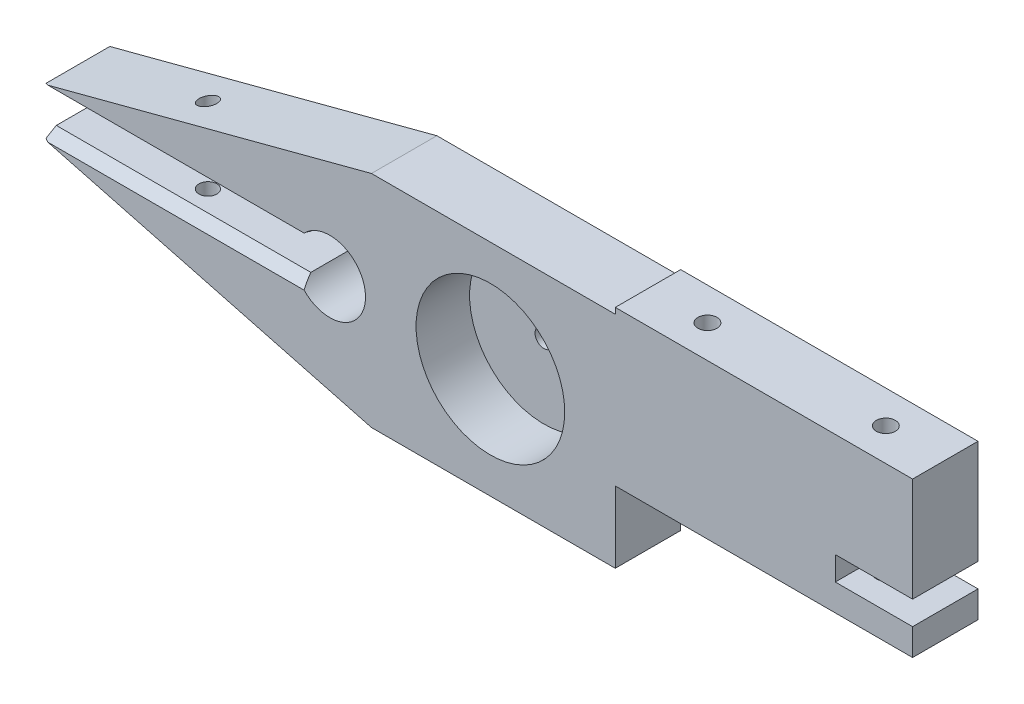
ISO-10303-21;
HEADER;
FILE_DESCRIPTION(('STEP AP214'),'2;1');
FILE_NAME('part.step','',(''),(''),'','','');
FILE_SCHEMA(('AUTOMOTIVE_DESIGN { 1 0 10303 214 1 1 1 1 }'));
ENDSEC;
DATA;
#1=APPLICATION_CONTEXT('core data for automotive mechanical design processes');
#2=APPLICATION_PROTOCOL_DEFINITION('international standard','automotive_design',2000,#1);
#3=PRODUCT_CONTEXT('',#1,'mechanical');
#4=PRODUCT('Part','Part','',(#3));
#5=PRODUCT_RELATED_PRODUCT_CATEGORY('part','',(#4));
#6=PRODUCT_DEFINITION_FORMATION('','',#4);
#7=PRODUCT_DEFINITION_CONTEXT('part definition',#1,'design');
#8=PRODUCT_DEFINITION('design','',#6,#7);
#9=PRODUCT_DEFINITION_SHAPE('','',#8);
#10=(LENGTH_UNIT() NAMED_UNIT(*) SI_UNIT(.MILLI.,.METRE.));
#11=(NAMED_UNIT(*) PLANE_ANGLE_UNIT() SI_UNIT($,.RADIAN.));
#12=(NAMED_UNIT(*) SI_UNIT($,.STERADIAN.) SOLID_ANGLE_UNIT());
#13=UNCERTAINTY_MEASURE_WITH_UNIT(LENGTH_MEASURE(1.E-05),#10,'distance_accuracy_value','');
#14=(GEOMETRIC_REPRESENTATION_CONTEXT(3) GLOBAL_UNCERTAINTY_ASSIGNED_CONTEXT((#13)) GLOBAL_UNIT_ASSIGNED_CONTEXT((#10,
#11,#12)) REPRESENTATION_CONTEXT('',''));
#15=CARTESIAN_POINT('',(0.,0.,0.));
#16=DIRECTION('',(0.,0.,1.));
#17=DIRECTION('',(1.,0.,0.));
#18=AXIS2_PLACEMENT_3D('',#15,#16,#17);
#19=CARTESIAN_POINT('',(61.,19.5,5.5));
#20=DIRECTION('',(-1.,0.,0.));
#21=DIRECTION('',(0.,0.,1.));
#22=AXIS2_PLACEMENT_3D('',#19,#20,#21);
#23=PLANE('',#22);
#24=DIRECTION('',(0.,1.,0.));
#25=VECTOR('',#24,1.);
#26=CARTESIAN_POINT('',(61.,19.5,-5.5));
#27=LINE('',#26,#25);
#28=CARTESIAN_POINT('',(61.,2.,-5.5));
#29=VERTEX_POINT('',#28);
#30=CARTESIAN_POINT('',(61.,19.5,-5.5));
#31=VERTEX_POINT('',#30);
#32=EDGE_CURVE('E170',#29,#31,#27,.T.);
#33=ORIENTED_EDGE('',*,*,#32,.T.);
#34=DIRECTION('',(0.,0.,-1.));
#35=VECTOR('',#34,1.);
#36=CARTESIAN_POINT('',(61.,19.5,5.5));
#37=LINE('',#36,#35);
#38=CARTESIAN_POINT('',(61.,19.5,5.5));
#39=VERTEX_POINT('',#38);
#40=EDGE_CURVE('E178',#39,#31,#37,.T.);
#41=ORIENTED_EDGE('',*,*,#40,.F.);
#42=DIRECTION('',(0.,1.,0.));
#43=VECTOR('',#42,1.);
#44=CARTESIAN_POINT('',(61.,19.5,5.5));
#45=LINE('',#44,#43);
#46=CARTESIAN_POINT('',(61.,2.,5.5));
#47=VERTEX_POINT('',#46);
#48=EDGE_CURVE('E235',#47,#39,#45,.T.);
#49=ORIENTED_EDGE('',*,*,#48,.F.);
#50=DIRECTION('',(0.,0.,-1.));
#51=VECTOR('',#50,1.);
#52=CARTESIAN_POINT('',(61.,2.,5.5));
#53=LINE('',#52,#51);
#54=EDGE_CURVE('E189',#47,#29,#53,.T.);
#55=ORIENTED_EDGE('',*,*,#54,.T.);
#56=EDGE_LOOP('',(#33,#41,#49,#55));
#57=FACE_BOUND('',#56,.T.);
#58=ADVANCED_FACE('F30',(#57),#23,.F.);
#59=CARTESIAN_POINT('',(61.,19.5,5.5));
#60=DIRECTION('',(0.,-1.,0.));
#61=DIRECTION('',(0.,0.,-1.));
#62=AXIS2_PLACEMENT_3D('',#59,#60,#61);
#63=PLANE('',#62);
#64=CARTESIAN_POINT('',(51.,19.5,0.));
#65=DIRECTION('',(0.,1.,0.));
#66=DIRECTION('',(0.,0.,1.));
#67=AXIS2_PLACEMENT_3D('',#64,#65,#66);
#68=CIRCLE('',#67,1.60000000000001);
#69=CARTESIAN_POINT('',(51.,19.5,1.60000000000001));
#70=VERTEX_POINT('',#69);
#71=EDGE_CURVE('E309',#70,#70,#68,.T.);
#72=ORIENTED_EDGE('',*,*,#71,.F.);
#73=EDGE_LOOP('',(#72));
#74=FACE_BOUND('',#73,.T.);
#75=CARTESIAN_POINT('',(21.,19.5,0.));
#76=DIRECTION('',(0.,1.,0.));
#77=DIRECTION('',(0.,0.,1.));
#78=AXIS2_PLACEMENT_3D('',#75,#76,#77);
#79=CIRCLE('',#78,1.60000000000001);
#80=CARTESIAN_POINT('',(21.,19.5,1.60000000000001));
#81=VERTEX_POINT('',#80);
#82=EDGE_CURVE('E193',#81,#81,#79,.T.);
#83=ORIENTED_EDGE('',*,*,#82,.F.);
#84=EDGE_LOOP('',(#83));
#85=FACE_BOUND('',#84,.T.);
#86=DIRECTION('',(-1.,0.,0.));
#87=VECTOR('',#86,1.);
#88=CARTESIAN_POINT('',(61.,19.5,-5.5));
#89=LINE('',#88,#87);
#90=CARTESIAN_POINT('',(11.,19.5,-5.5));
#91=VERTEX_POINT('',#90);
#92=EDGE_CURVE('E165',#31,#91,#89,.T.);
#93=ORIENTED_EDGE('',*,*,#92,.T.);
#94=DIRECTION('',(0.,0.,-1.));
#95=VECTOR('',#94,1.);
#96=CARTESIAN_POINT('',(11.,19.5,5.5));
#97=LINE('',#96,#95);
#98=CARTESIAN_POINT('',(11.,19.5,5.5));
#99=VERTEX_POINT('',#98);
#100=EDGE_CURVE('E185',#99,#91,#97,.T.);
#101=ORIENTED_EDGE('',*,*,#100,.F.);
#102=DIRECTION('',(-1.,0.,0.));
#103=VECTOR('',#102,1.);
#104=CARTESIAN_POINT('',(61.,19.5,5.5));
#105=LINE('',#104,#103);
#106=EDGE_CURVE('E180',#39,#99,#105,.T.);
#107=ORIENTED_EDGE('',*,*,#106,.F.);
#108=ORIENTED_EDGE('',*,*,#40,.T.);
#109=EDGE_LOOP('',(#93,#101,#107,#108));
#110=FACE_BOUND('',#109,.T.);
#111=ADVANCED_FACE('F179',(#74,#85,#110),#63,.F.);
#112=CARTESIAN_POINT('',(11.,19.5,5.5));
#113=DIRECTION('',(1.,0.,0.));
#114=DIRECTION('',(0.,1.,0.));
#115=AXIS2_PLACEMENT_3D('',#112,#113,#114);
#116=PLANE('',#115);
#117=DIRECTION('',(0.,-1.,0.));
#118=VECTOR('',#117,1.);
#119=CARTESIAN_POINT('',(11.,19.5,-5.5));
#120=LINE('',#119,#118);
#121=CARTESIAN_POINT('',(11.,18.5,-5.5));
#122=VERTEX_POINT('',#121);
#123=EDGE_CURVE('E172',#91,#122,#120,.T.);
#124=ORIENTED_EDGE('',*,*,#123,.T.);
#125=DIRECTION('',(0.,0.,-1.));
#126=VECTOR('',#125,1.);
#127=CARTESIAN_POINT('',(11.,18.5,5.5));
#128=LINE('',#127,#126);
#129=CARTESIAN_POINT('',(11.,18.5,5.5));
#130=VERTEX_POINT('',#129);
#131=EDGE_CURVE('E301',#130,#122,#128,.T.);
#132=ORIENTED_EDGE('',*,*,#131,.F.);
#133=DIRECTION('',(0.,-1.,0.));
#134=VECTOR('',#133,1.);
#135=CARTESIAN_POINT('',(11.,19.5,5.5));
#136=LINE('',#135,#134);
#137=EDGE_CURVE('E238',#99,#130,#136,.T.);
#138=ORIENTED_EDGE('',*,*,#137,.F.);
#139=ORIENTED_EDGE('',*,*,#100,.T.);
#140=EDGE_LOOP('',(#124,#132,#138,#139));
#141=FACE_BOUND('',#140,.T.);
#142=ADVANCED_FACE('F390',(#141),#116,.F.);
#143=CARTESIAN_POINT('',(-30.,18.5,5.5));
#144=DIRECTION('',(0.,-1.,0.));
#145=DIRECTION('',(1.,0.,0.));
#146=AXIS2_PLACEMENT_3D('',#143,#144,#145);
#147=PLANE('',#146);
#148=DIRECTION('',(-1.,0.,0.));
#149=VECTOR('',#148,1.);
#150=CARTESIAN_POINT('',(-30.,18.5,-5.5));
#151=LINE('',#150,#149);
#152=CARTESIAN_POINT('',(-30.,18.5,-5.5));
#153=VERTEX_POINT('',#152);
#154=EDGE_CURVE('E199',#122,#153,#151,.T.);
#155=ORIENTED_EDGE('',*,*,#154,.T.);
#156=DIRECTION('',(0.,0.,-1.));
#157=VECTOR('',#156,1.);
#158=CARTESIAN_POINT('',(-30.,18.5,5.5));
#159=LINE('',#158,#157);
#160=CARTESIAN_POINT('',(-30.,18.5,5.5));
#161=VERTEX_POINT('',#160);
#162=EDGE_CURVE('E298',#161,#153,#159,.T.);
#163=ORIENTED_EDGE('',*,*,#162,.F.);
#164=DIRECTION('',(-1.,0.,0.));
#165=VECTOR('',#164,1.);
#166=CARTESIAN_POINT('',(-30.,18.5,5.5));
#167=LINE('',#166,#165);
#168=EDGE_CURVE('E240',#130,#161,#167,.T.);
#169=ORIENTED_EDGE('',*,*,#168,.F.);
#170=ORIENTED_EDGE('',*,*,#131,.T.);
#171=EDGE_LOOP('',(#155,#163,#169,#170));
#172=FACE_BOUND('',#171,.T.);
#173=ADVANCED_FACE('F394',(#172),#147,.F.);
#174=CARTESIAN_POINT('',(-30.,18.5,5.5));
#175=DIRECTION('',(0.254925969305079,-0.966960573226161,0.));
#176=DIRECTION('',(0.966960573226161,0.254925969305079,0.));
#177=AXIS2_PLACEMENT_3D('',#174,#175,#176);
#178=PLANE('',#177);
#179=CARTESIAN_POINT('',(-63.,9.79999999999999,0.));
#180=DIRECTION('',(0.254925969305079,-0.966960573226161,0.));
#181=DIRECTION('',(0.966960573226161,0.254925969305079,0.));
#182=AXIS2_PLACEMENT_3D('',#179,#180,#181);
#183=ELLIPSE('',#182,1.55125249315534,1.5);
#184=CARTESIAN_POINT('',(-61.5,10.1954545454545,0.));
#185=VERTEX_POINT('',#184);
#186=EDGE_CURVE('E445',#185,#185,#183,.T.);
#187=ORIENTED_EDGE('',*,*,#186,.T.);
#188=EDGE_LOOP('',(#187));
#189=FACE_BOUND('',#188,.T.);
#190=DIRECTION('',(0.,0.,-1.));
#191=VECTOR('',#190,1.);
#192=CARTESIAN_POINT('',(-85.,3.99999999999999,5.5));
#193=LINE('',#192,#191);
#194=CARTESIAN_POINT('',(-85.,3.99999999999999,5.23205080756888));
#195=VERTEX_POINT('',#194);
#196=CARTESIAN_POINT('',(-85.,3.99999999999999,-5.5));
#197=VERTEX_POINT('',#196);
#198=EDGE_CURVE('E296',#195,#197,#193,.T.);
#199=ORIENTED_EDGE('',*,*,#198,.F.);
#200=DIRECTION('',(0.884569100485295,0.233204581037032,0.403922182913959));
#201=VECTOR('',#200,1.);
#202=CARTESIAN_POINT('',(-47.3141503576231,13.935360360263,22.4405997430505));
#203=LINE('',#202,#201);
#204=CARTESIAN_POINT('',(-84.4132048544235,4.15470053837924,5.5));
#205=VERTEX_POINT('',#204);
#206=EDGE_CURVE('E11',#195,#205,#203,.T.);
#207=ORIENTED_EDGE('',*,*,#206,.T.);
#208=DIRECTION('',(-0.966960573226161,-0.254925969305079,0.));
#209=VECTOR('',#208,1.);
#210=CARTESIAN_POINT('',(-30.,18.5,5.5));
#211=LINE('',#210,#209);
#212=EDGE_CURVE('E242',#161,#205,#211,.T.);
#213=ORIENTED_EDGE('',*,*,#212,.F.);
#214=ORIENTED_EDGE('',*,*,#162,.T.);
#215=DIRECTION('',(-0.966960573226161,-0.254925969305079,0.));
#216=VECTOR('',#215,1.);
#217=CARTESIAN_POINT('',(-30.,18.5,-5.5));
#218=LINE('',#217,#216);
#219=EDGE_CURVE('E201',#153,#197,#218,.T.);
#220=ORIENTED_EDGE('',*,*,#219,.T.);
#221=EDGE_LOOP('',(#199,#207,#213,#214,#220));
#222=FACE_BOUND('',#221,.T.);
#223=ADVANCED_FACE('F430',(#189,#222),#178,.F.);
#224=CARTESIAN_POINT('',(-85.,3.99999999999999,5.5));
#225=DIRECTION('',(1.,0.,0.));
#226=DIRECTION('',(0.,0.,-1.));
#227=AXIS2_PLACEMENT_3D('',#224,#225,#226);
#228=PLANE('',#227);
#229=DIRECTION('',(0.,0.,-1.));
#230=VECTOR('',#229,1.);
#231=CARTESIAN_POINT('',(-85.,2.99999999999999,5.5));
#232=LINE('',#231,#230);
#233=CARTESIAN_POINT('',(-85.,2.99999999999999,3.49999999999997));
#234=VERTEX_POINT('',#233);
#235=CARTESIAN_POINT('',(-85.,2.99999999999999,-5.5));
#236=VERTEX_POINT('',#235);
#237=EDGE_CURVE('E294',#234,#236,#232,.T.);
#238=ORIENTED_EDGE('',*,*,#237,.F.);
#239=DIRECTION('',(0.,0.499999999999995,0.866025403784442));
#240=VECTOR('',#239,1.);
#241=CARTESIAN_POINT('',(-85.,4.15470053837924,5.5));
#242=LINE('',#241,#240);
#243=EDGE_CURVE('E37',#234,#195,#242,.T.);
#244=ORIENTED_EDGE('',*,*,#243,.T.);
#245=ORIENTED_EDGE('',*,*,#198,.T.);
#246=DIRECTION('',(0.,-1.,0.));
#247=VECTOR('',#246,1.);
#248=CARTESIAN_POINT('',(-85.,3.99999999999999,-5.5));
#249=LINE('',#248,#247);
#250=EDGE_CURVE('E204',#197,#236,#249,.T.);
#251=ORIENTED_EDGE('',*,*,#250,.T.);
#252=EDGE_LOOP('',(#238,#244,#245,#251));
#253=FACE_BOUND('',#252,.T.);
#254=ADVANCED_FACE('F433',(#253),#228,.F.);
#255=CARTESIAN_POINT('',(-85.,2.99999999999999,5.5));
#256=DIRECTION('',(0.,1.,0.));
#257=DIRECTION('',(-1.,0.,0.));
#258=AXIS2_PLACEMENT_3D('',#255,#256,#257);
#259=PLANE('',#258);
#260=CARTESIAN_POINT('',(-63.,2.99999999999999,0.));
#261=DIRECTION('',(0.,1.,0.));
#262=DIRECTION('',(-1.,0.,0.));
#263=AXIS2_PLACEMENT_3D('',#260,#261,#262);
#264=CIRCLE('',#263,1.5);
#265=CARTESIAN_POINT('',(-64.5,2.99999999999999,0.));
#266=VERTEX_POINT('',#265);
#267=EDGE_CURVE('E443',#266,#266,#264,.T.);
#268=ORIENTED_EDGE('',*,*,#267,.T.);
#269=EDGE_LOOP('',(#268));
#270=FACE_BOUND('',#269,.T.);
#271=DIRECTION('',(0.,0.,-1.));
#272=VECTOR('',#271,1.);
#273=CARTESIAN_POINT('',(-42.1961524227066,2.99999999999999,5.5));
#274=LINE('',#273,#272);
#275=CARTESIAN_POINT('',(-42.1961524227066,2.99999999999999,3.49999999999997));
#276=VERTEX_POINT('',#275);
#277=CARTESIAN_POINT('',(-42.1961524227066,2.99999999999999,-5.5));
#278=VERTEX_POINT('',#277);
#279=EDGE_CURVE('E292',#276,#278,#274,.T.);
#280=ORIENTED_EDGE('',*,*,#279,.F.);
#281=DIRECTION('',(-1.,0.,0.));
#282=VECTOR('',#281,1.);
#283=CARTESIAN_POINT('',(-85.,2.99999999999999,3.49999999999997));
#284=LINE('',#283,#282);
#285=EDGE_CURVE('E51',#276,#234,#284,.T.);
#286=ORIENTED_EDGE('',*,*,#285,.T.);
#287=ORIENTED_EDGE('',*,*,#237,.T.);
#288=DIRECTION('',(1.,0.,0.));
#289=VECTOR('',#288,1.);
#290=CARTESIAN_POINT('',(-85.,2.99999999999999,-5.5));
#291=LINE('',#290,#289);
#292=EDGE_CURVE('E207',#236,#278,#291,.T.);
#293=ORIENTED_EDGE('',*,*,#292,.T.);
#294=EDGE_LOOP('',(#280,#286,#287,#293));
#295=FACE_BOUND('',#294,.T.);
#296=ADVANCED_FACE('F400',(#270,#295),#259,.F.);
#297=CARTESIAN_POINT('',(-37.,0.,5.5));
#298=DIRECTION('',(0.,0.,-1.));
#299=DIRECTION('',(-1.,0.,0.));
#300=AXIS2_PLACEMENT_3D('',#297,#298,#299);
#301=CYLINDRICAL_SURFACE('',#300,6.);
#302=DIRECTION('',(0.,0.,-1.));
#303=VECTOR('',#302,1.);
#304=CARTESIAN_POINT('',(-42.1961524227066,-3.00000000000001,5.5));
#305=LINE('',#304,#303);
#306=CARTESIAN_POINT('',(-42.1961524227066,-3.00000000000001,3.5));
#307=VERTEX_POINT('',#306);
#308=CARTESIAN_POINT('',(-42.1961524227066,-3.00000000000001,-5.5));
#309=VERTEX_POINT('',#308);
#310=EDGE_CURVE('E290',#307,#309,#305,.T.);
#311=ORIENTED_EDGE('',*,*,#310,.F.);
#312=CARTESIAN_POINT('',(-37.,0.,-1.6961524227067));
#313=DIRECTION('',(0.,0.866025403784441,0.499999999999995));
#314=DIRECTION('',(0.,0.499999999999995,-0.866025403784441));
#315=AXIS2_PLACEMENT_3D('',#312,#313,#314);
#316=ELLIPSE('',#315,12.0000000000001,6.);
#317=CARTESIAN_POINT('',(-41.3287946863291,-4.15470053837925,5.5));
#318=VERTEX_POINT('',#317);
#319=EDGE_CURVE('E328',#307,#318,#316,.T.);
#320=ORIENTED_EDGE('',*,*,#319,.T.);
#321=CARTESIAN_POINT('',(-37.,0.,5.5));
#322=DIRECTION('',(0.,0.,-1.));
#323=DIRECTION('',(1.,0.,0.));
#324=AXIS2_PLACEMENT_3D('',#321,#322,#323);
#325=CIRCLE('',#324,6.);
#326=CARTESIAN_POINT('',(-41.3287946863291,4.15470053837924,5.5));
#327=VERTEX_POINT('',#326);
#328=EDGE_CURVE('E245',#327,#318,#325,.T.);
#329=ORIENTED_EDGE('',*,*,#328,.F.);
#330=CARTESIAN_POINT('',(-37.,0.,-1.69615242270673));
#331=DIRECTION('',(0.,-0.866025403784442,0.499999999999995));
#332=DIRECTION('',(0.,-0.499999999999995,-0.866025403784442));
#333=AXIS2_PLACEMENT_3D('',#330,#331,#332);
#334=ELLIPSE('',#333,12.0000000000001,6.);
#335=EDGE_CURVE('E326',#327,#276,#334,.T.);
#336=ORIENTED_EDGE('',*,*,#335,.T.);
#337=ORIENTED_EDGE('',*,*,#279,.T.);
#338=CARTESIAN_POINT('',(-37.,0.,-5.5));
#339=DIRECTION('',(0.,0.,-1.));
#340=DIRECTION('',(1.,0.,0.));
#341=AXIS2_PLACEMENT_3D('',#338,#339,#340);
#342=CIRCLE('',#341,6.);
#343=EDGE_CURVE('E210',#278,#309,#342,.T.);
#344=ORIENTED_EDGE('',*,*,#343,.T.);
#345=EDGE_LOOP('',(#311,#320,#329,#336,#337,#344));
#346=FACE_BOUND('',#345,.T.);
#347=ADVANCED_FACE('F334',(#346),#301,.F.);
#348=CARTESIAN_POINT('',(-85.,-3.00000000000001,5.5));
#349=DIRECTION('',(0.,-1.,0.));
#350=DIRECTION('',(1.,0.,0.));
#351=AXIS2_PLACEMENT_3D('',#348,#349,#350);
#352=PLANE('',#351);
#353=CARTESIAN_POINT('',(-63.,-3.00000000000001,0.));
#354=DIRECTION('',(0.,-1.,0.));
#355=DIRECTION('',(1.,0.,0.));
#356=AXIS2_PLACEMENT_3D('',#353,#354,#355);
#357=CIRCLE('',#356,1.5);
#358=CARTESIAN_POINT('',(-61.5,-3.00000000000001,0.));
#359=VERTEX_POINT('',#358);
#360=EDGE_CURVE('E313',#359,#359,#357,.T.);
#361=ORIENTED_EDGE('',*,*,#360,.T.);
#362=EDGE_LOOP('',(#361));
#363=FACE_BOUND('',#362,.T.);
#364=DIRECTION('',(0.,0.,-1.));
#365=VECTOR('',#364,1.);
#366=CARTESIAN_POINT('',(-85.,-3.00000000000001,5.5));
#367=LINE('',#366,#365);
#368=CARTESIAN_POINT('',(-85.,-3.00000000000001,3.5));
#369=VERTEX_POINT('',#368);
#370=CARTESIAN_POINT('',(-85.,-3.00000000000001,-5.5));
#371=VERTEX_POINT('',#370);
#372=EDGE_CURVE('E288',#369,#371,#367,.T.);
#373=ORIENTED_EDGE('',*,*,#372,.F.);
#374=DIRECTION('',(1.,0.,0.));
#375=VECTOR('',#374,1.);
#376=CARTESIAN_POINT('',(-42.1961524227066,-3.00000000000001,3.5));
#377=LINE('',#376,#375);
#378=EDGE_CURVE('E324',#369,#307,#377,.T.);
#379=ORIENTED_EDGE('',*,*,#378,.T.);
#380=ORIENTED_EDGE('',*,*,#310,.T.);
#381=DIRECTION('',(-1.,0.,0.));
#382=VECTOR('',#381,1.);
#383=CARTESIAN_POINT('',(-85.,-3.00000000000001,-5.5));
#384=LINE('',#383,#382);
#385=EDGE_CURVE('E213',#309,#371,#384,.T.);
#386=ORIENTED_EDGE('',*,*,#385,.T.);
#387=EDGE_LOOP('',(#373,#379,#380,#386));
#388=FACE_BOUND('',#387,.T.);
#389=ADVANCED_FACE('F405',(#363,#388),#352,.F.);
#390=CARTESIAN_POINT('',(-85.,-4.00000000000001,5.5));
#391=DIRECTION('',(1.,0.,0.));
#392=DIRECTION('',(0.,0.,-1.));
#393=AXIS2_PLACEMENT_3D('',#390,#391,#392);
#394=PLANE('',#393);
#395=DIRECTION('',(0.,0.,-1.));
#396=VECTOR('',#395,1.);
#397=CARTESIAN_POINT('',(-85.,-4.00000000000001,5.5));
#398=LINE('',#397,#396);
#399=CARTESIAN_POINT('',(-85.,-4.00000000000001,5.2320508075689));
#400=VERTEX_POINT('',#399);
#401=CARTESIAN_POINT('',(-85.,-4.00000000000001,-5.5));
#402=VERTEX_POINT('',#401);
#403=EDGE_CURVE('E286',#400,#402,#398,.T.);
#404=ORIENTED_EDGE('',*,*,#403,.F.);
#405=DIRECTION('',(0.,0.499999999999995,-0.866025403784441));
#406=VECTOR('',#405,1.);
#407=CARTESIAN_POINT('',(-85.,-4.15470053837925,5.5));
#408=LINE('',#407,#406);
#409=EDGE_CURVE('E322',#400,#369,#408,.T.);
#410=ORIENTED_EDGE('',*,*,#409,.T.);
#411=ORIENTED_EDGE('',*,*,#372,.T.);
#412=DIRECTION('',(0.,-1.,0.));
#413=VECTOR('',#412,1.);
#414=CARTESIAN_POINT('',(-85.,-4.00000000000001,-5.5));
#415=LINE('',#414,#413);
#416=EDGE_CURVE('E216',#371,#402,#415,.T.);
#417=ORIENTED_EDGE('',*,*,#416,.T.);
#418=EDGE_LOOP('',(#404,#410,#411,#417));
#419=FACE_BOUND('',#418,.T.);
#420=ADVANCED_FACE('F349',(#419),#394,.F.);
#421=CARTESIAN_POINT('',(-85.,-4.00000000000001,5.5));
#422=DIRECTION('',(0.254925969305079,0.966960573226161,0.));
#423=DIRECTION('',(-0.966960573226161,0.254925969305079,0.));
#424=AXIS2_PLACEMENT_3D('',#421,#422,#423);
#425=PLANE('',#424);
#426=CARTESIAN_POINT('',(-63.,-9.8,0.));
#427=DIRECTION('',(0.254925969305079,0.966960573226161,0.));
#428=DIRECTION('',(-0.966960573226161,0.254925969305079,0.));
#429=AXIS2_PLACEMENT_3D('',#426,#427,#428);
#430=ELLIPSE('',#429,1.55125249315534,1.5);
#431=CARTESIAN_POINT('',(-64.5,-9.40454545454546,0.));
#432=VERTEX_POINT('',#431);
#433=EDGE_CURVE('E310',#432,#432,#430,.T.);
#434=ORIENTED_EDGE('',*,*,#433,.T.);
#435=EDGE_LOOP('',(#434));
#436=FACE_BOUND('',#435,.T.);
#437=DIRECTION('',(0.966960573226161,-0.254925969305078,0.));
#438=VECTOR('',#437,1.);
#439=CARTESIAN_POINT('',(-85.,-4.00000000000001,5.5));
#440=LINE('',#439,#438);
#441=CARTESIAN_POINT('',(-84.4132048544236,-4.15470053837924,5.5));
#442=VERTEX_POINT('',#441);
#443=CARTESIAN_POINT('',(-30.,-18.5,5.5));
#444=VERTEX_POINT('',#443);
#445=EDGE_CURVE('E248',#442,#444,#440,.T.);
#446=ORIENTED_EDGE('',*,*,#445,.F.);
#447=DIRECTION('',(-0.884569100485296,0.233204581037032,-0.403922182913958));
#448=VECTOR('',#447,1.);
#449=CARTESIAN_POINT('',(-47.3141503576231,-13.935360360263,22.4405997430504));
#450=LINE('',#449,#448);
#451=EDGE_CURVE('E320',#442,#400,#450,.T.);
#452=ORIENTED_EDGE('',*,*,#451,.T.);
#453=ORIENTED_EDGE('',*,*,#403,.T.);
#454=DIRECTION('',(0.966960573226161,-0.254925969305078,0.));
#455=VECTOR('',#454,1.);
#456=CARTESIAN_POINT('',(-85.,-4.00000000000001,-5.5));
#457=LINE('',#456,#455);
#458=CARTESIAN_POINT('',(-30.,-18.5,-5.5));
#459=VERTEX_POINT('',#458);
#460=EDGE_CURVE('E219',#402,#459,#457,.T.);
#461=ORIENTED_EDGE('',*,*,#460,.T.);
#462=DIRECTION('',(0.,0.,-1.));
#463=VECTOR('',#462,1.);
#464=CARTESIAN_POINT('',(-30.,-18.5,5.5));
#465=LINE('',#464,#463);
#466=EDGE_CURVE('E283',#444,#459,#465,.T.);
#467=ORIENTED_EDGE('',*,*,#466,.F.);
#468=EDGE_LOOP('',(#446,#452,#453,#461,#467));
#469=FACE_BOUND('',#468,.T.);
#470=ADVANCED_FACE('F346',(#436,#469),#425,.F.);
#471=CARTESIAN_POINT('',(11.,-18.5,5.5));
#472=DIRECTION('',(0.,1.,0.));
#473=DIRECTION('',(-1.,0.,0.));
#474=AXIS2_PLACEMENT_3D('',#471,#472,#473);
#475=PLANE('',#474);
#476=DIRECTION('',(1.,0.,0.));
#477=VECTOR('',#476,1.);
#478=CARTESIAN_POINT('',(11.,-18.5,-5.5));
#479=LINE('',#478,#477);
#480=CARTESIAN_POINT('',(11.,-18.5,-5.5));
#481=VERTEX_POINT('',#480);
#482=EDGE_CURVE('E221',#459,#481,#479,.T.);
#483=ORIENTED_EDGE('',*,*,#482,.T.);
#484=DIRECTION('',(0.,0.,-1.));
#485=VECTOR('',#484,1.);
#486=CARTESIAN_POINT('',(11.,-18.5,5.5));
#487=LINE('',#486,#485);
#488=CARTESIAN_POINT('',(11.,-18.5,5.5));
#489=VERTEX_POINT('',#488);
#490=EDGE_CURVE('E280',#489,#481,#487,.T.);
#491=ORIENTED_EDGE('',*,*,#490,.F.);
#492=DIRECTION('',(1.,0.,0.));
#493=VECTOR('',#492,1.);
#494=CARTESIAN_POINT('',(11.,-18.5,5.5));
#495=LINE('',#494,#493);
#496=EDGE_CURVE('E250',#444,#489,#495,.T.);
#497=ORIENTED_EDGE('',*,*,#496,.F.);
#498=ORIENTED_EDGE('',*,*,#466,.T.);
#499=EDGE_LOOP('',(#483,#491,#497,#498));
#500=FACE_BOUND('',#499,.T.);
#501=ADVANCED_FACE('F358',(#500),#475,.F.);
#502=CARTESIAN_POINT('',(11.,-6.5,5.5));
#503=DIRECTION('',(-1.,0.,0.));
#504=DIRECTION('',(0.,-1.,0.));
#505=AXIS2_PLACEMENT_3D('',#502,#503,#504);
#506=PLANE('',#505);
#507=DIRECTION('',(0.,1.,0.));
#508=VECTOR('',#507,1.);
#509=CARTESIAN_POINT('',(11.,-6.5,-5.5));
#510=LINE('',#509,#508);
#511=CARTESIAN_POINT('',(11.,-6.5,-5.5));
#512=VERTEX_POINT('',#511);
#513=EDGE_CURVE('E223',#481,#512,#510,.T.);
#514=ORIENTED_EDGE('',*,*,#513,.T.);
#515=DIRECTION('',(0.,0.,-1.));
#516=VECTOR('',#515,1.);
#517=CARTESIAN_POINT('',(11.,-6.5,5.5));
#518=LINE('',#517,#516);
#519=CARTESIAN_POINT('',(11.,-6.5,5.5));
#520=VERTEX_POINT('',#519);
#521=EDGE_CURVE('E277',#520,#512,#518,.T.);
#522=ORIENTED_EDGE('',*,*,#521,.F.);
#523=DIRECTION('',(0.,1.,0.));
#524=VECTOR('',#523,1.);
#525=CARTESIAN_POINT('',(11.,-6.5,5.5));
#526=LINE('',#525,#524);
#527=EDGE_CURVE('E252',#489,#520,#526,.T.);
#528=ORIENTED_EDGE('',*,*,#527,.F.);
#529=ORIENTED_EDGE('',*,*,#490,.T.);
#530=EDGE_LOOP('',(#514,#522,#528,#529));
#531=FACE_BOUND('',#530,.T.);
#532=ADVANCED_FACE('F365',(#531),#506,.F.);
#533=CARTESIAN_POINT('',(61.,-6.5,5.5));
#534=DIRECTION('',(0.,1.,0.));
#535=DIRECTION('',(-1.,0.,0.));
#536=AXIS2_PLACEMENT_3D('',#533,#534,#535);
#537=PLANE('',#536);
#538=CARTESIAN_POINT('',(51.,-6.5,0.));
#539=DIRECTION('',(0.,1.,0.));
#540=DIRECTION('',(-1.,0.,0.));
#541=AXIS2_PLACEMENT_3D('',#538,#539,#540);
#542=CIRCLE('',#541,1.60000000000001);
#543=CARTESIAN_POINT('',(49.4,-6.5,0.));
#544=VERTEX_POINT('',#543);
#545=EDGE_CURVE('E455',#544,#544,#542,.T.);
#546=ORIENTED_EDGE('',*,*,#545,.T.);
#547=EDGE_LOOP('',(#546));
#548=FACE_BOUND('',#547,.T.);
#549=CARTESIAN_POINT('',(21.,-6.5,0.));
#550=DIRECTION('',(0.,1.,0.));
#551=DIRECTION('',(-1.,0.,0.));
#552=AXIS2_PLACEMENT_3D('',#549,#550,#551);
#553=CIRCLE('',#552,1.60000000000001);
#554=CARTESIAN_POINT('',(19.4,-6.5,0.));
#555=VERTEX_POINT('',#554);
#556=EDGE_CURVE('E190',#555,#555,#553,.T.);
#557=ORIENTED_EDGE('',*,*,#556,.T.);
#558=EDGE_LOOP('',(#557));
#559=FACE_BOUND('',#558,.T.);
#560=DIRECTION('',(1.,0.,0.));
#561=VECTOR('',#560,1.);
#562=CARTESIAN_POINT('',(61.,-6.5,-5.5));
#563=LINE('',#562,#561);
#564=CARTESIAN_POINT('',(61.,-6.5,-5.5));
#565=VERTEX_POINT('',#564);
#566=EDGE_CURVE('E225',#512,#565,#563,.T.);
#567=ORIENTED_EDGE('',*,*,#566,.T.);
#568=DIRECTION('',(0.,0.,-1.));
#569=VECTOR('',#568,1.);
#570=CARTESIAN_POINT('',(61.,-6.5,5.5));
#571=LINE('',#570,#569);
#572=CARTESIAN_POINT('',(61.,-6.5,5.5));
#573=VERTEX_POINT('',#572);
#574=EDGE_CURVE('E274',#573,#565,#571,.T.);
#575=ORIENTED_EDGE('',*,*,#574,.F.);
#576=DIRECTION('',(1.,0.,0.));
#577=VECTOR('',#576,1.);
#578=CARTESIAN_POINT('',(61.,-6.5,5.5));
#579=LINE('',#578,#577);
#580=EDGE_CURVE('E254',#520,#573,#579,.T.);
#581=ORIENTED_EDGE('',*,*,#580,.F.);
#582=ORIENTED_EDGE('',*,*,#521,.T.);
#583=EDGE_LOOP('',(#567,#575,#581,#582));
#584=FACE_BOUND('',#583,.T.);
#585=ADVANCED_FACE('F368',(#548,#559,#584),#537,.F.);
#586=CARTESIAN_POINT('',(61.,-2.,5.5));
#587=DIRECTION('',(-1.,0.,0.));
#588=DIRECTION('',(0.,-1.,0.));
#589=AXIS2_PLACEMENT_3D('',#586,#587,#588);
#590=PLANE('',#589);
#591=DIRECTION('',(0.,1.,0.));
#592=VECTOR('',#591,1.);
#593=CARTESIAN_POINT('',(61.,-2.,-5.5));
#594=LINE('',#593,#592);
#595=CARTESIAN_POINT('',(61.,-2.,-5.5));
#596=VERTEX_POINT('',#595);
#597=EDGE_CURVE('E227',#565,#596,#594,.T.);
#598=ORIENTED_EDGE('',*,*,#597,.T.);
#599=DIRECTION('',(0.,0.,-1.));
#600=VECTOR('',#599,1.);
#601=CARTESIAN_POINT('',(61.,-2.,5.5));
#602=LINE('',#601,#600);
#603=CARTESIAN_POINT('',(61.,-2.,5.5));
#604=VERTEX_POINT('',#603);
#605=EDGE_CURVE('E271',#604,#596,#602,.T.);
#606=ORIENTED_EDGE('',*,*,#605,.F.);
#607=DIRECTION('',(0.,1.,0.));
#608=VECTOR('',#607,1.);
#609=CARTESIAN_POINT('',(61.,-2.,5.5));
#610=LINE('',#609,#608);
#611=EDGE_CURVE('E256',#573,#604,#610,.T.);
#612=ORIENTED_EDGE('',*,*,#611,.F.);
#613=ORIENTED_EDGE('',*,*,#574,.T.);
#614=EDGE_LOOP('',(#598,#606,#612,#613));
#615=FACE_BOUND('',#614,.T.);
#616=ADVANCED_FACE('F373',(#615),#590,.F.);
#617=CARTESIAN_POINT('',(61.,-2.,5.5));
#618=DIRECTION('',(0.,-1.,0.));
#619=DIRECTION('',(1.,0.,0.));
#620=AXIS2_PLACEMENT_3D('',#617,#618,#619);
#621=PLANE('',#620);
#622=CARTESIAN_POINT('',(51.,-2.,0.));
#623=DIRECTION('',(0.,-1.,0.));
#624=DIRECTION('',(1.,0.,0.));
#625=AXIS2_PLACEMENT_3D('',#622,#623,#624);
#626=CIRCLE('',#625,1.60000000000001);
#627=CARTESIAN_POINT('',(52.6,-2.,0.));
#628=VERTEX_POINT('',#627);
#629=EDGE_CURVE('E308',#628,#628,#626,.T.);
#630=ORIENTED_EDGE('',*,*,#629,.T.);
#631=EDGE_LOOP('',(#630));
#632=FACE_BOUND('',#631,.T.);
#633=DIRECTION('',(-1.,0.,0.));
#634=VECTOR('',#633,1.);
#635=CARTESIAN_POINT('',(61.,-2.,-5.5));
#636=LINE('',#635,#634);
#637=CARTESIAN_POINT('',(48.,-2.,-5.5));
#638=VERTEX_POINT('',#637);
#639=EDGE_CURVE('E229',#596,#638,#636,.T.);
#640=ORIENTED_EDGE('',*,*,#639,.T.);
#641=DIRECTION('',(0.,0.,-1.));
#642=VECTOR('',#641,1.);
#643=CARTESIAN_POINT('',(48.,-2.,5.5));
#644=LINE('',#643,#642);
#645=CARTESIAN_POINT('',(48.,-2.,5.5));
#646=VERTEX_POINT('',#645);
#647=EDGE_CURVE('E268',#646,#638,#644,.T.);
#648=ORIENTED_EDGE('',*,*,#647,.F.);
#649=DIRECTION('',(-1.,0.,0.));
#650=VECTOR('',#649,1.);
#651=CARTESIAN_POINT('',(61.,-2.,5.5));
#652=LINE('',#651,#650);
#653=EDGE_CURVE('E258',#604,#646,#652,.T.);
#654=ORIENTED_EDGE('',*,*,#653,.F.);
#655=ORIENTED_EDGE('',*,*,#605,.T.);
#656=EDGE_LOOP('',(#640,#648,#654,#655));
#657=FACE_BOUND('',#656,.T.);
#658=ADVANCED_FACE('F379',(#632,#657),#621,.F.);
#659=CARTESIAN_POINT('',(48.,2.,5.5));
#660=DIRECTION('',(-1.,0.,0.));
#661=DIRECTION('',(0.,0.,1.));
#662=AXIS2_PLACEMENT_3D('',#659,#660,#661);
#663=PLANE('',#662);
#664=DIRECTION('',(0.,1.,0.));
#665=VECTOR('',#664,1.);
#666=CARTESIAN_POINT('',(48.,2.,-5.5));
#667=LINE('',#666,#665);
#668=CARTESIAN_POINT('',(48.,2.,-5.5));
#669=VERTEX_POINT('',#668);
#670=EDGE_CURVE('E231',#638,#669,#667,.T.);
#671=ORIENTED_EDGE('',*,*,#670,.T.);
#672=DIRECTION('',(0.,0.,-1.));
#673=VECTOR('',#672,1.);
#674=CARTESIAN_POINT('',(48.,2.,5.5));
#675=LINE('',#674,#673);
#676=CARTESIAN_POINT('',(48.,2.,5.5));
#677=VERTEX_POINT('',#676);
#678=EDGE_CURVE('E265',#677,#669,#675,.T.);
#679=ORIENTED_EDGE('',*,*,#678,.F.);
#680=DIRECTION('',(0.,1.,0.));
#681=VECTOR('',#680,1.);
#682=CARTESIAN_POINT('',(48.,2.,5.5));
#683=LINE('',#682,#681);
#684=EDGE_CURVE('E260',#646,#677,#683,.T.);
#685=ORIENTED_EDGE('',*,*,#684,.F.);
#686=ORIENTED_EDGE('',*,*,#647,.T.);
#687=EDGE_LOOP('',(#671,#679,#685,#686));
#688=FACE_BOUND('',#687,.T.);
#689=ADVANCED_FACE('F383',(#688),#663,.F.);
#690=CARTESIAN_POINT('',(61.,2.,5.5));
#691=DIRECTION('',(0.,1.,0.));
#692=DIRECTION('',(-1.,0.,0.));
#693=AXIS2_PLACEMENT_3D('',#690,#691,#692);
#694=PLANE('',#693);
#695=CARTESIAN_POINT('',(51.,2.,0.));
#696=DIRECTION('',(0.,1.,0.));
#697=DIRECTION('',(-1.,0.,0.));
#698=AXIS2_PLACEMENT_3D('',#695,#696,#697);
#699=CIRCLE('',#698,1.60000000000001);
#700=CARTESIAN_POINT('',(49.4,2.,0.));
#701=VERTEX_POINT('',#700);
#702=EDGE_CURVE('E305',#701,#701,#699,.T.);
#703=ORIENTED_EDGE('',*,*,#702,.T.);
#704=EDGE_LOOP('',(#703));
#705=FACE_BOUND('',#704,.T.);
#706=DIRECTION('',(1.,0.,0.));
#707=VECTOR('',#706,1.);
#708=CARTESIAN_POINT('',(61.,2.,-5.5));
#709=LINE('',#708,#707);
#710=EDGE_CURVE('E233',#669,#29,#709,.T.);
#711=ORIENTED_EDGE('',*,*,#710,.T.);
#712=ORIENTED_EDGE('',*,*,#54,.F.);
#713=DIRECTION('',(1.,0.,0.));
#714=VECTOR('',#713,1.);
#715=CARTESIAN_POINT('',(61.,2.,5.5));
#716=LINE('',#715,#714);
#717=EDGE_CURVE('E262',#677,#47,#716,.T.);
#718=ORIENTED_EDGE('',*,*,#717,.F.);
#719=ORIENTED_EDGE('',*,*,#678,.T.);
#720=EDGE_LOOP('',(#711,#712,#718,#719));
#721=FACE_BOUND('',#720,.T.);
#722=ADVANCED_FACE('F386',(#705,#721),#694,.F.);
#723=CARTESIAN_POINT('',(-37.,0.,5.5));
#724=DIRECTION('',(0.,0.,1.));
#725=DIRECTION('',(1.,0.,0.));
#726=AXIS2_PLACEMENT_3D('',#723,#724,#725);
#727=PLANE('',#726);
#728=CARTESIAN_POINT('',(-10.,0.,5.5));
#729=DIRECTION('',(0.,0.,1.));
#730=DIRECTION('',(1.,0.,0.));
#731=AXIS2_PLACEMENT_3D('',#728,#729,#730);
#732=CIRCLE('',#731,12.5);
#733=CARTESIAN_POINT('',(2.5,0.,5.5));
#734=VERTEX_POINT('',#733);
#735=EDGE_CURVE('E653',#734,#734,#732,.T.);
#736=ORIENTED_EDGE('',*,*,#735,.F.);
#737=EDGE_LOOP('',(#736));
#738=FACE_BOUND('',#737,.T.);
#739=ORIENTED_EDGE('',*,*,#328,.T.);
#740=DIRECTION('',(-1.,0.,0.));
#741=VECTOR('',#740,1.);
#742=CARTESIAN_POINT('',(-85.,-4.15470053837925,5.5));
#743=LINE('',#742,#741);
#744=EDGE_CURVE('E317',#318,#442,#743,.T.);
#745=ORIENTED_EDGE('',*,*,#744,.T.);
#746=ORIENTED_EDGE('',*,*,#445,.T.);
#747=ORIENTED_EDGE('',*,*,#496,.T.);
#748=ORIENTED_EDGE('',*,*,#527,.T.);
#749=ORIENTED_EDGE('',*,*,#580,.T.);
#750=ORIENTED_EDGE('',*,*,#611,.T.);
#751=ORIENTED_EDGE('',*,*,#653,.T.);
#752=ORIENTED_EDGE('',*,*,#684,.T.);
#753=ORIENTED_EDGE('',*,*,#717,.T.);
#754=ORIENTED_EDGE('',*,*,#48,.T.);
#755=ORIENTED_EDGE('',*,*,#106,.T.);
#756=ORIENTED_EDGE('',*,*,#137,.T.);
#757=ORIENTED_EDGE('',*,*,#168,.T.);
#758=ORIENTED_EDGE('',*,*,#212,.T.);
#759=DIRECTION('',(1.,0.,0.));
#760=VECTOR('',#759,1.);
#761=CARTESIAN_POINT('',(-42.1961524227066,4.15470053837924,5.5));
#762=LINE('',#761,#760);
#763=EDGE_CURVE('E184',#205,#327,#762,.T.);
#764=ORIENTED_EDGE('',*,*,#763,.T.);
#765=EDGE_LOOP('',(#739,#745,#746,#747,#748,#749,#750,#751,#752,#753,#754,#755,#756,#757,#758,#764));
#766=FACE_BOUND('',#765,.T.);
#767=ADVANCED_FACE('F339',(#738,#766),#727,.T.);
#768=CARTESIAN_POINT('',(-37.,0.,-5.5));
#769=DIRECTION('',(0.,0.,1.));
#770=DIRECTION('',(1.,0.,0.));
#771=AXIS2_PLACEMENT_3D('',#768,#769,#770);
#772=PLANE('',#771);
#773=CARTESIAN_POINT('',(-10.,0.,-5.5));
#774=DIRECTION('',(0.,0.,1.));
#775=DIRECTION('',(1.,0.,0.));
#776=AXIS2_PLACEMENT_3D('',#773,#774,#775);
#777=CIRCLE('',#776,1.5);
#778=CARTESIAN_POINT('',(-8.5,0.,-5.5));
#779=VERTEX_POINT('',#778);
#780=EDGE_CURVE('E314',#779,#779,#777,.T.);
#781=ORIENTED_EDGE('',*,*,#780,.T.);
#782=EDGE_LOOP('',(#781));
#783=FACE_BOUND('',#782,.T.);
#784=ORIENTED_EDGE('',*,*,#32,.F.);
#785=ORIENTED_EDGE('',*,*,#710,.F.);
#786=ORIENTED_EDGE('',*,*,#670,.F.);
#787=ORIENTED_EDGE('',*,*,#639,.F.);
#788=ORIENTED_EDGE('',*,*,#597,.F.);
#789=ORIENTED_EDGE('',*,*,#566,.F.);
#790=ORIENTED_EDGE('',*,*,#513,.F.);
#791=ORIENTED_EDGE('',*,*,#482,.F.);
#792=ORIENTED_EDGE('',*,*,#460,.F.);
#793=ORIENTED_EDGE('',*,*,#416,.F.);
#794=ORIENTED_EDGE('',*,*,#385,.F.);
#795=ORIENTED_EDGE('',*,*,#343,.F.);
#796=ORIENTED_EDGE('',*,*,#292,.F.);
#797=ORIENTED_EDGE('',*,*,#250,.F.);
#798=ORIENTED_EDGE('',*,*,#219,.F.);
#799=ORIENTED_EDGE('',*,*,#154,.F.);
#800=ORIENTED_EDGE('',*,*,#123,.F.);
#801=ORIENTED_EDGE('',*,*,#92,.F.);
#802=EDGE_LOOP('',(#784,#785,#786,#787,#788,#789,#790,#791,#792,#793,#794,#795,#796,#797,#798,
#799,#800,#801));
#803=FACE_BOUND('',#802,.T.);
#804=ADVANCED_FACE('F167',(#783,#803),#772,.F.);
#805=CARTESIAN_POINT('',(21.,-18.5,0.));
#806=DIRECTION('',(0.,1.,0.));
#807=DIRECTION('',(0.,0.,1.));
#808=AXIS2_PLACEMENT_3D('',#805,#806,#807);
#809=CYLINDRICAL_SURFACE('',#808,1.60000000000001);
#810=ORIENTED_EDGE('',*,*,#82,.T.);
#811=EDGE_LOOP('',(#810));
#812=FACE_BOUND('',#811,.T.);
#813=ORIENTED_EDGE('',*,*,#556,.F.);
#814=EDGE_LOOP('',(#813));
#815=FACE_BOUND('',#814,.T.);
#816=ADVANCED_FACE('F462',(#812,#815),#809,.F.);
#817=CARTESIAN_POINT('',(51.,-18.5,0.));
#818=DIRECTION('',(0.,1.,0.));
#819=DIRECTION('',(0.,0.,1.));
#820=AXIS2_PLACEMENT_3D('',#817,#818,#819);
#821=CYLINDRICAL_SURFACE('',#820,1.60000000000001);
#822=ORIENTED_EDGE('',*,*,#71,.T.);
#823=EDGE_LOOP('',(#822));
#824=FACE_BOUND('',#823,.T.);
#825=ORIENTED_EDGE('',*,*,#702,.F.);
#826=EDGE_LOOP('',(#825));
#827=FACE_BOUND('',#826,.T.);
#828=ADVANCED_FACE('F465',(#824,#827),#821,.F.);
#829=ORIENTED_EDGE('',*,*,#629,.F.);
#830=EDGE_LOOP('',(#829));
#831=FACE_BOUND('',#830,.T.);
#832=ORIENTED_EDGE('',*,*,#545,.F.);
#833=EDGE_LOOP('',(#832));
#834=FACE_BOUND('',#833,.T.);
#835=ADVANCED_FACE('F491',(#831,#834),#821,.F.);
#836=CARTESIAN_POINT('',(-63.,-18.5,0.));
#837=DIRECTION('',(0.,1.,0.));
#838=DIRECTION('',(0.,0.,1.));
#839=AXIS2_PLACEMENT_3D('',#836,#837,#838);
#840=CYLINDRICAL_SURFACE('',#839,1.5);
#841=ORIENTED_EDGE('',*,*,#433,.F.);
#842=EDGE_LOOP('',(#841));
#843=FACE_BOUND('',#842,.T.);
#844=ORIENTED_EDGE('',*,*,#360,.F.);
#845=EDGE_LOOP('',(#844));
#846=FACE_BOUND('',#845,.T.);
#847=ADVANCED_FACE('F487',(#843,#846),#840,.F.);
#848=ORIENTED_EDGE('',*,*,#267,.F.);
#849=EDGE_LOOP('',(#848));
#850=FACE_BOUND('',#849,.T.);
#851=ORIENTED_EDGE('',*,*,#186,.F.);
#852=EDGE_LOOP('',(#851));
#853=FACE_BOUND('',#852,.T.);
#854=ADVANCED_FACE('F490',(#850,#853),#840,.F.);
#855=CARTESIAN_POINT('',(-37.,-4.15470053837925,5.5));
#856=DIRECTION('',(0.,0.866025403784441,0.499999999999995));
#857=DIRECTION('',(0.,-0.499999999999995,0.866025403784441));
#858=AXIS2_PLACEMENT_3D('',#855,#856,#857);
#859=PLANE('',#858);
#860=ORIENTED_EDGE('',*,*,#319,.F.);
#861=ORIENTED_EDGE('',*,*,#378,.F.);
#862=ORIENTED_EDGE('',*,*,#409,.F.);
#863=ORIENTED_EDGE('',*,*,#451,.F.);
#864=ORIENTED_EDGE('',*,*,#744,.F.);
#865=EDGE_LOOP('',(#860,#861,#862,#863,#864));
#866=FACE_BOUND('',#865,.T.);
#867=ADVANCED_FACE('F342',(#866),#859,.T.);
#868=CARTESIAN_POINT('',(-37.,4.15470053837924,5.5));
#869=DIRECTION('',(0.,-0.866025403784442,0.499999999999995));
#870=DIRECTION('',(0.,-0.499999999999995,-0.866025403784442));
#871=AXIS2_PLACEMENT_3D('',#868,#869,#870);
#872=PLANE('',#871);
#873=ORIENTED_EDGE('',*,*,#243,.F.);
#874=ORIENTED_EDGE('',*,*,#285,.F.);
#875=ORIENTED_EDGE('',*,*,#335,.F.);
#876=ORIENTED_EDGE('',*,*,#763,.F.);
#877=ORIENTED_EDGE('',*,*,#206,.F.);
#878=EDGE_LOOP('',(#873,#874,#875,#876,#877));
#879=FACE_BOUND('',#878,.T.);
#880=ADVANCED_FACE('F399',(#879),#872,.T.);
#881=CARTESIAN_POINT('',(-10.,0.,-5.5));
#882=DIRECTION('',(0.,0.,1.));
#883=DIRECTION('',(1.,0.,0.));
#884=AXIS2_PLACEMENT_3D('',#881,#882,#883);
#885=CYLINDRICAL_SURFACE('',#884,1.5);
#886=ORIENTED_EDGE('',*,*,#780,.F.);
#887=EDGE_LOOP('',(#886));
#888=FACE_BOUND('',#887,.T.);
#889=CARTESIAN_POINT('',(-10.,0.,-3.5));
#890=DIRECTION('',(0.,0.,1.));
#891=DIRECTION('',(1.,0.,0.));
#892=AXIS2_PLACEMENT_3D('',#889,#890,#891);
#893=CIRCLE('',#892,1.5);
#894=CARTESIAN_POINT('',(-8.5,0.,-3.5));
#895=VERTEX_POINT('',#894);
#896=EDGE_CURVE('E655',#895,#895,#893,.T.);
#897=ORIENTED_EDGE('',*,*,#896,.T.);
#898=EDGE_LOOP('',(#897));
#899=FACE_BOUND('',#898,.T.);
#900=ADVANCED_FACE('F615',(#888,#899),#885,.F.);
#901=CARTESIAN_POINT('',(2.5,0.,-3.5));
#902=DIRECTION('',(0.,0.,-1.));
#903=DIRECTION('',(-1.,0.,0.));
#904=AXIS2_PLACEMENT_3D('',#901,#902,#903);
#905=PLANE('',#904);
#906=ORIENTED_EDGE('',*,*,#896,.F.);
#907=EDGE_LOOP('',(#906));
#908=FACE_BOUND('',#907,.T.);
#909=CARTESIAN_POINT('',(-10.,0.,-3.5));
#910=DIRECTION('',(0.,0.,1.));
#911=DIRECTION('',(1.,0.,0.));
#912=AXIS2_PLACEMENT_3D('',#909,#910,#911);
#913=CIRCLE('',#912,12.5);
#914=CARTESIAN_POINT('',(2.5,0.,-3.5));
#915=VERTEX_POINT('',#914);
#916=EDGE_CURVE('E650',#915,#915,#913,.T.);
#917=ORIENTED_EDGE('',*,*,#916,.T.);
#918=EDGE_LOOP('',(#917));
#919=FACE_BOUND('',#918,.T.);
#920=ADVANCED_FACE('F623',(#908,#919),#905,.F.);
#921=CARTESIAN_POINT('',(-10.,0.,-5.5));
#922=DIRECTION('',(0.,0.,1.));
#923=DIRECTION('',(1.,0.,0.));
#924=AXIS2_PLACEMENT_3D('',#921,#922,#923);
#925=CYLINDRICAL_SURFACE('',#924,12.5);
#926=ORIENTED_EDGE('',*,*,#916,.F.);
#927=EDGE_LOOP('',(#926));
#928=FACE_BOUND('',#927,.T.);
#929=ORIENTED_EDGE('',*,*,#735,.T.);
#930=EDGE_LOOP('',(#929));
#931=FACE_BOUND('',#930,.T.);
#932=ADVANCED_FACE('F630',(#928,#931),#925,.F.);
#933=CLOSED_SHELL('',(#58,#111,#142,#173,#223,#254,#296,#347,#389,#420,#470,#501,#532,#585,#616,
#658,#689,#722,#767,#804,#816,#828,#835,#847,#854,#867,#880,#900,#920,#932));
#934=MANIFOLD_SOLID_BREP('B2',#933);
#935=ADVANCED_BREP_SHAPE_REPRESENTATION('',(#18,#934),#14);
#936=SHAPE_DEFINITION_REPRESENTATION(#9,#935);
ENDSEC;
END-ISO-10303-21;
